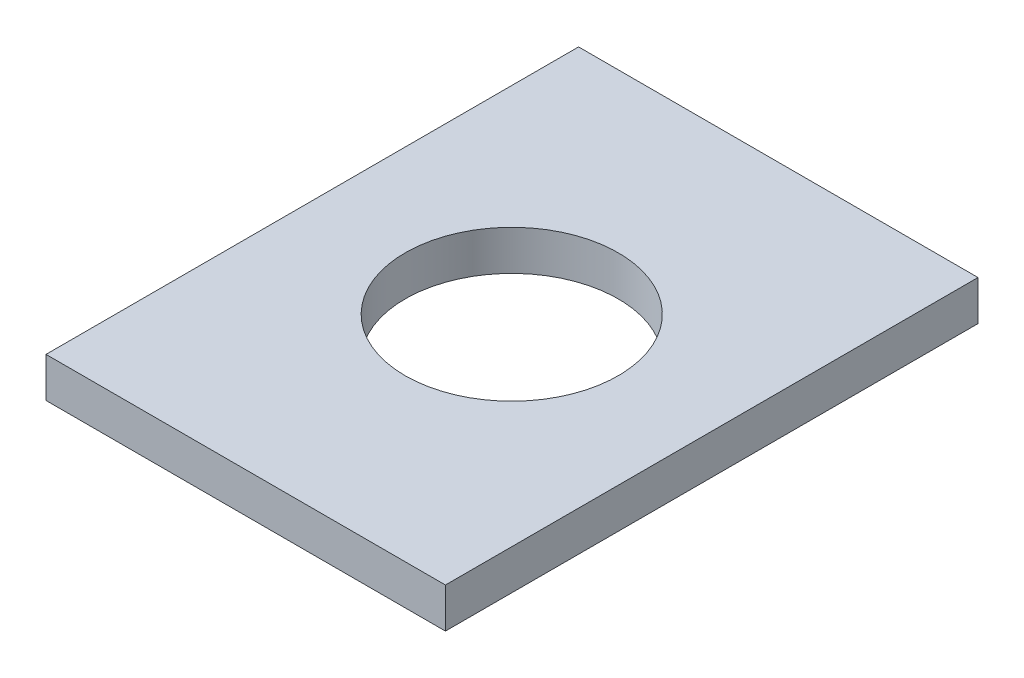
ISO-10303-21;
HEADER;
FILE_DESCRIPTION(('STEP AP214'),'2;1');
FILE_NAME('part.step','',(''),(''),'','','');
FILE_SCHEMA(('AUTOMOTIVE_DESIGN { 1 0 10303 214 1 1 1 1 }'));
ENDSEC;
DATA;
#1=APPLICATION_CONTEXT('core data for automotive mechanical design processes');
#2=APPLICATION_PROTOCOL_DEFINITION('international standard','automotive_design',2000,#1);
#3=PRODUCT_CONTEXT('',#1,'mechanical');
#4=PRODUCT('Part','Part','',(#3));
#5=PRODUCT_RELATED_PRODUCT_CATEGORY('part','',(#4));
#6=PRODUCT_DEFINITION_FORMATION('','',#4);
#7=PRODUCT_DEFINITION_CONTEXT('part definition',#1,'design');
#8=PRODUCT_DEFINITION('design','',#6,#7);
#9=PRODUCT_DEFINITION_SHAPE('','',#8);
#10=(LENGTH_UNIT() NAMED_UNIT(*) SI_UNIT(.MILLI.,.METRE.));
#11=(NAMED_UNIT(*) PLANE_ANGLE_UNIT() SI_UNIT($,.RADIAN.));
#12=(NAMED_UNIT(*) SI_UNIT($,.STERADIAN.) SOLID_ANGLE_UNIT());
#13=UNCERTAINTY_MEASURE_WITH_UNIT(LENGTH_MEASURE(1.E-05),#10,'distance_accuracy_value','');
#14=(GEOMETRIC_REPRESENTATION_CONTEXT(3) GLOBAL_UNCERTAINTY_ASSIGNED_CONTEXT((#13)) GLOBAL_UNIT_ASSIGNED_CONTEXT((#10,
#11,#12)) REPRESENTATION_CONTEXT('',''));
#15=CARTESIAN_POINT('',(0.,0.,0.));
#16=DIRECTION('',(0.,0.,1.));
#17=DIRECTION('',(1.,0.,0.));
#18=AXIS2_PLACEMENT_3D('',#15,#16,#17);
#19=CARTESIAN_POINT('',(-45.0000001483128,20.,-35.));
#20=DIRECTION('',(0.,1.,0.));
#21=DIRECTION('',(0.,0.,1.));
#22=AXIS2_PLACEMENT_3D('',#19,#20,#21);
#23=PLANE('',#22);
#24=CARTESIAN_POINT('',(12.44,20.,9.95000000000001));
#25=DIRECTION('',(0.,1.,0.));
#26=DIRECTION('',(0.,0.,1.));
#27=AXIS2_PLACEMENT_3D('',#24,#25,#26);
#28=CIRCLE('',#27,4.);
#29=CARTESIAN_POINT('',(12.44,20.,13.95));
#30=VERTEX_POINT('',#29);
#31=EDGE_CURVE('E123',#30,#30,#28,.T.);
#32=ORIENTED_EDGE('',*,*,#31,.T.);
#33=EDGE_LOOP('',(#32));
#34=FACE_BOUND('',#33,.T.);
#35=DIRECTION('',(-1.,0.,0.));
#36=VECTOR('',#35,1.);
#37=CARTESIAN_POINT('',(-45.0000001483128,20.,0.));
#38=LINE('',#37,#36);
#39=CARTESIAN_POINT('',(19.9999998516872,20.,0.));
#40=VERTEX_POINT('',#39);
#41=CARTESIAN_POINT('',(4.99999985168721,20.,0.));
#42=VERTEX_POINT('',#41);
#43=EDGE_CURVE('E63',#40,#42,#38,.T.);
#44=ORIENTED_EDGE('',*,*,#43,.F.);
#45=DIRECTION('',(0.,0.,-1.));
#46=VECTOR('',#45,1.);
#47=CARTESIAN_POINT('',(19.9999998516872,20.,-35.));
#48=LINE('',#47,#46);
#49=CARTESIAN_POINT('',(19.9999998516872,20.,20.));
#50=VERTEX_POINT('',#49);
#51=EDGE_CURVE('E115',#50,#40,#48,.T.);
#52=ORIENTED_EDGE('',*,*,#51,.F.);
#53=DIRECTION('',(1.,0.,0.));
#54=VECTOR('',#53,1.);
#55=CARTESIAN_POINT('',(-45.0000001483128,20.,20.));
#56=LINE('',#55,#54);
#57=CARTESIAN_POINT('',(4.99999985168721,20.,20.));
#58=VERTEX_POINT('',#57);
#59=EDGE_CURVE('E109',#58,#50,#56,.T.);
#60=ORIENTED_EDGE('',*,*,#59,.F.);
#61=DIRECTION('',(0.,0.,1.));
#62=VECTOR('',#61,1.);
#63=CARTESIAN_POINT('',(4.99999985168721,20.,-35.));
#64=LINE('',#63,#62);
#65=EDGE_CURVE('E102',#42,#58,#64,.T.);
#66=ORIENTED_EDGE('',*,*,#65,.F.);
#67=EDGE_LOOP('',(#44,#52,#60,#66));
#68=FACE_BOUND('',#67,.T.);
#69=ADVANCED_FACE('F48',(#34,#68),#23,.F.);
#70=CARTESIAN_POINT('',(-45.0000001483128,21.5,-35.));
#71=DIRECTION('',(0.,1.,0.));
#72=DIRECTION('',(0.,0.,1.));
#73=AXIS2_PLACEMENT_3D('',#70,#71,#72);
#74=PLANE('',#73);
#75=CARTESIAN_POINT('',(12.44,21.5,9.95000000000001));
#76=DIRECTION('',(0.,1.,0.));
#77=DIRECTION('',(0.,0.,1.));
#78=AXIS2_PLACEMENT_3D('',#75,#76,#77);
#79=CIRCLE('',#78,4.);
#80=CARTESIAN_POINT('',(12.44,21.5,13.95));
#81=VERTEX_POINT('',#80);
#82=EDGE_CURVE('E119',#81,#81,#79,.T.);
#83=ORIENTED_EDGE('',*,*,#82,.F.);
#84=EDGE_LOOP('',(#83));
#85=FACE_BOUND('',#84,.T.);
#86=DIRECTION('',(0.,0.,-1.));
#87=VECTOR('',#86,1.);
#88=CARTESIAN_POINT('',(19.9999998516872,21.5,-35.));
#89=LINE('',#88,#87);
#90=CARTESIAN_POINT('',(19.9999998516872,21.5,20.));
#91=VERTEX_POINT('',#90);
#92=CARTESIAN_POINT('',(19.9999998516872,21.5,0.));
#93=VERTEX_POINT('',#92);
#94=EDGE_CURVE('E95',#91,#93,#89,.T.);
#95=ORIENTED_EDGE('',*,*,#94,.T.);
#96=DIRECTION('',(-1.,0.,0.));
#97=VECTOR('',#96,1.);
#98=CARTESIAN_POINT('',(-45.0000001483128,21.5,0.));
#99=LINE('',#98,#97);
#100=CARTESIAN_POINT('',(4.99999985168721,21.5,0.));
#101=VERTEX_POINT('',#100);
#102=EDGE_CURVE('E88',#93,#101,#99,.T.);
#103=ORIENTED_EDGE('',*,*,#102,.T.);
#104=DIRECTION('',(0.,0.,1.));
#105=VECTOR('',#104,1.);
#106=CARTESIAN_POINT('',(4.99999985168721,21.5,-35.));
#107=LINE('',#106,#105);
#108=CARTESIAN_POINT('',(4.99999985168721,21.5,20.));
#109=VERTEX_POINT('',#108);
#110=EDGE_CURVE('E70',#101,#109,#107,.T.);
#111=ORIENTED_EDGE('',*,*,#110,.T.);
#112=DIRECTION('',(1.,0.,0.));
#113=VECTOR('',#112,1.);
#114=CARTESIAN_POINT('',(-45.0000001483128,21.5,20.));
#115=LINE('',#114,#113);
#116=EDGE_CURVE('E213',#109,#91,#115,.T.);
#117=ORIENTED_EDGE('',*,*,#116,.T.);
#118=EDGE_LOOP('',(#95,#103,#111,#117));
#119=FACE_BOUND('',#118,.T.);
#120=ADVANCED_FACE('F93',(#85,#119),#74,.T.);
#121=CARTESIAN_POINT('',(19.9999998516872,0.,0.));
#122=DIRECTION('',(1.,0.,0.));
#123=DIRECTION('',(0.,0.,-1.));
#124=AXIS2_PLACEMENT_3D('',#121,#122,#123);
#125=PLANE('',#124);
#126=ORIENTED_EDGE('',*,*,#51,.T.);
#127=DIRECTION('',(0.,1.,0.));
#128=VECTOR('',#127,1.);
#129=CARTESIAN_POINT('',(19.9999998516872,0.,0.));
#130=LINE('',#129,#128);
#131=EDGE_CURVE('E208',#40,#93,#130,.T.);
#132=ORIENTED_EDGE('',*,*,#131,.T.);
#133=ORIENTED_EDGE('',*,*,#94,.F.);
#134=DIRECTION('',(0.,-1.,0.));
#135=VECTOR('',#134,1.);
#136=CARTESIAN_POINT('',(19.9999998516872,0.,20.));
#137=LINE('',#136,#135);
#138=EDGE_CURVE('E103',#91,#50,#137,.T.);
#139=ORIENTED_EDGE('',*,*,#138,.T.);
#140=EDGE_LOOP('',(#126,#132,#133,#139));
#141=FACE_BOUND('',#140,.T.);
#142=ADVANCED_FACE('F142',(#141),#125,.T.);
#143=CARTESIAN_POINT('',(4.99999985168721,0.,0.));
#144=DIRECTION('',(-1.,0.,0.));
#145=DIRECTION('',(0.,0.,1.));
#146=AXIS2_PLACEMENT_3D('',#143,#144,#145);
#147=PLANE('',#146);
#148=ORIENTED_EDGE('',*,*,#110,.F.);
#149=DIRECTION('',(0.,-1.,0.));
#150=VECTOR('',#149,1.);
#151=CARTESIAN_POINT('',(4.99999985168721,0.,0.));
#152=LINE('',#151,#150);
#153=EDGE_CURVE('E11',#101,#42,#152,.T.);
#154=ORIENTED_EDGE('',*,*,#153,.T.);
#155=ORIENTED_EDGE('',*,*,#65,.T.);
#156=DIRECTION('',(0.,1.,0.));
#157=VECTOR('',#156,1.);
#158=CARTESIAN_POINT('',(4.99999985168721,0.,20.));
#159=LINE('',#158,#157);
#160=EDGE_CURVE('E56',#58,#109,#159,.T.);
#161=ORIENTED_EDGE('',*,*,#160,.T.);
#162=EDGE_LOOP('',(#148,#154,#155,#161));
#163=FACE_BOUND('',#162,.T.);
#164=ADVANCED_FACE('F99',(#163),#147,.T.);
#165=CARTESIAN_POINT('',(12.44,18.5,9.95000000000001));
#166=DIRECTION('',(0.,1.,0.));
#167=DIRECTION('',(0.,0.,1.));
#168=AXIS2_PLACEMENT_3D('',#165,#166,#167);
#169=CYLINDRICAL_SURFACE('',#168,4.);
#170=ORIENTED_EDGE('',*,*,#82,.T.);
#171=EDGE_LOOP('',(#170));
#172=FACE_BOUND('',#171,.T.);
#173=ORIENTED_EDGE('',*,*,#31,.F.);
#174=EDGE_LOOP('',(#173));
#175=FACE_BOUND('',#174,.T.);
#176=ADVANCED_FACE('F131',(#172,#175),#169,.F.);
#177=CARTESIAN_POINT('',(0.,0.,20.));
#178=DIRECTION('',(0.,0.,1.));
#179=DIRECTION('',(1.,0.,0.));
#180=AXIS2_PLACEMENT_3D('',#177,#178,#179);
#181=PLANE('',#180);
#182=ORIENTED_EDGE('',*,*,#116,.F.);
#183=ORIENTED_EDGE('',*,*,#160,.F.);
#184=ORIENTED_EDGE('',*,*,#59,.T.);
#185=ORIENTED_EDGE('',*,*,#138,.F.);
#186=EDGE_LOOP('',(#182,#183,#184,#185));
#187=FACE_BOUND('',#186,.T.);
#188=ADVANCED_FACE('F133',(#187),#181,.T.);
#189=CARTESIAN_POINT('',(0.,0.,0.));
#190=DIRECTION('',(0.,0.,-1.));
#191=DIRECTION('',(-1.,0.,0.));
#192=AXIS2_PLACEMENT_3D('',#189,#190,#191);
#193=PLANE('',#192);
#194=ORIENTED_EDGE('',*,*,#43,.T.);
#195=ORIENTED_EDGE('',*,*,#153,.F.);
#196=ORIENTED_EDGE('',*,*,#102,.F.);
#197=ORIENTED_EDGE('',*,*,#131,.F.);
#198=EDGE_LOOP('',(#194,#195,#196,#197));
#199=FACE_BOUND('',#198,.T.);
#200=ADVANCED_FACE('F87',(#199),#193,.T.);
#201=CLOSED_SHELL('',(#69,#120,#142,#164,#176,#188,#200));
#202=MANIFOLD_SOLID_BREP('B2',#201);
#203=ADVANCED_BREP_SHAPE_REPRESENTATION('',(#18,#202),#14);
#204=SHAPE_DEFINITION_REPRESENTATION(#9,#203);
ENDSEC;
END-ISO-10303-21;
